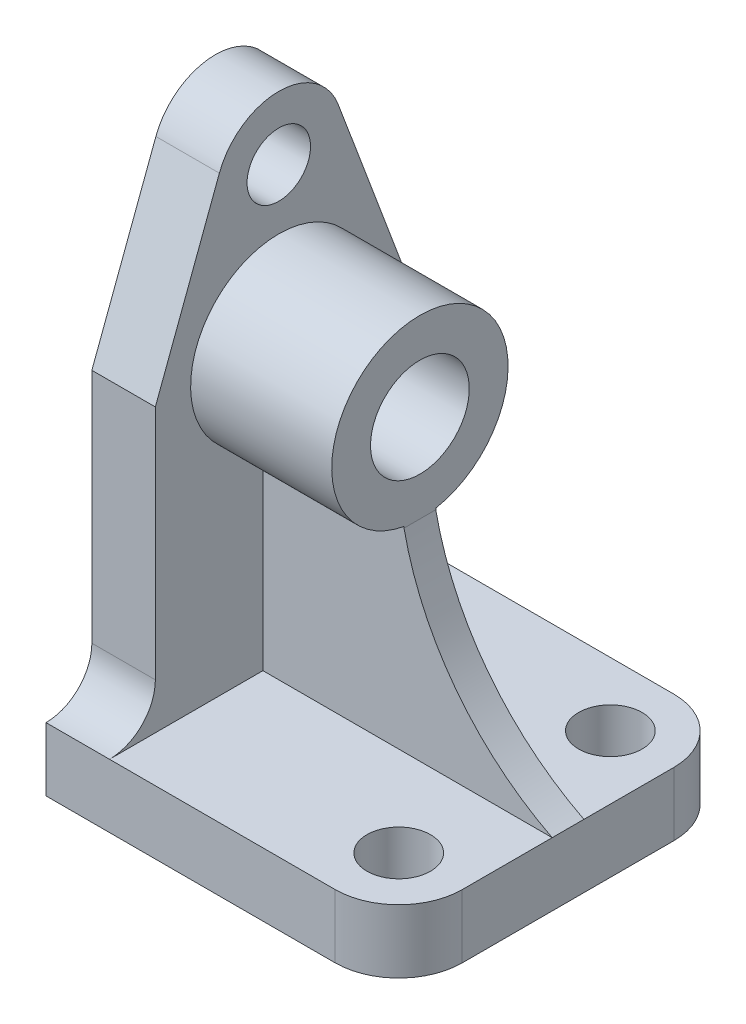
ISO-10303-21;
HEADER;
FILE_DESCRIPTION(('STEP AP214'),'2;1');
FILE_NAME('part.step','',(''),(''),'','','');
FILE_SCHEMA(('AUTOMOTIVE_DESIGN { 1 0 10303 214 1 1 1 1 }'));
ENDSEC;
DATA;
#1=APPLICATION_CONTEXT('core data for automotive mechanical design processes');
#2=APPLICATION_PROTOCOL_DEFINITION('international standard','automotive_design',2000,#1);
#3=PRODUCT_CONTEXT('',#1,'mechanical');
#4=PRODUCT('Part','Part','',(#3));
#5=PRODUCT_RELATED_PRODUCT_CATEGORY('part','',(#4));
#6=PRODUCT_DEFINITION_FORMATION('','',#4);
#7=PRODUCT_DEFINITION_CONTEXT('part definition',#1,'design');
#8=PRODUCT_DEFINITION('design','',#6,#7);
#9=PRODUCT_DEFINITION_SHAPE('','',#8);
#10=(LENGTH_UNIT() NAMED_UNIT(*) SI_UNIT(.MILLI.,.METRE.));
#11=(NAMED_UNIT(*) PLANE_ANGLE_UNIT() SI_UNIT($,.RADIAN.));
#12=(NAMED_UNIT(*) SI_UNIT($,.STERADIAN.) SOLID_ANGLE_UNIT());
#13=UNCERTAINTY_MEASURE_WITH_UNIT(LENGTH_MEASURE(1.E-05),#10,'distance_accuracy_value','');
#14=(GEOMETRIC_REPRESENTATION_CONTEXT(3) GLOBAL_UNCERTAINTY_ASSIGNED_CONTEXT((#13)) GLOBAL_UNIT_ASSIGNED_CONTEXT((#10,
#11,#12)) REPRESENTATION_CONTEXT('',''));
#15=CARTESIAN_POINT('',(0.,0.,0.));
#16=DIRECTION('',(0.,0.,1.));
#17=DIRECTION('',(1.,0.,0.));
#18=AXIS2_PLACEMENT_3D('',#15,#16,#17);
#19=CARTESIAN_POINT('',(0.,18.,48.));
#20=DIRECTION('',(0.,-1.,0.));
#21=DIRECTION('',(0.,0.,-1.));
#22=AXIS2_PLACEMENT_3D('',#19,#20,#21);
#23=PLANE('',#22);
#24=CARTESIAN_POINT('',(82.,18.,-30.));
#25=DIRECTION('',(0.,1.,0.));
#26=DIRECTION('',(0.,0.,1.));
#27=AXIS2_PLACEMENT_3D('',#24,#25,#26);
#28=CIRCLE('',#27,9.);
#29=CARTESIAN_POINT('',(82.,18.,-21.));
#30=VERTEX_POINT('',#29);
#31=EDGE_CURVE('E257',#30,#30,#28,.T.);
#32=ORIENTED_EDGE('',*,*,#31,.F.);
#33=EDGE_LOOP('',(#32));
#34=FACE_BOUND('',#33,.T.);
#35=DIRECTION('',(-1.,0.,0.));
#36=VECTOR('',#35,1.);
#37=CARTESIAN_POINT('',(82.,18.,-4.5));
#38=LINE('',#37,#36);
#39=CARTESIAN_POINT('',(99.9999999999999,18.,-4.5));
#40=VERTEX_POINT('',#39);
#41=CARTESIAN_POINT('',(18.,18.,-4.5));
#42=VERTEX_POINT('',#41);
#43=EDGE_CURVE('E192',#40,#42,#38,.T.);
#44=ORIENTED_EDGE('',*,*,#43,.F.);
#45=DIRECTION('',(0.,0.,-1.));
#46=VECTOR('',#45,1.);
#47=CARTESIAN_POINT('',(100.,18.,48.));
#48=LINE('',#47,#46);
#49=CARTESIAN_POINT('',(100.,18.,-30.));
#50=VERTEX_POINT('',#49);
#51=EDGE_CURVE('E276',#40,#50,#48,.T.);
#52=ORIENTED_EDGE('',*,*,#51,.T.);
#53=CARTESIAN_POINT('',(82.,18.,-30.));
#54=DIRECTION('',(0.,-1.,0.));
#55=DIRECTION('',(0.,0.,-1.));
#56=AXIS2_PLACEMENT_3D('',#53,#54,#55);
#57=CIRCLE('',#56,18.);
#58=CARTESIAN_POINT('',(82.,18.,-48.));
#59=VERTEX_POINT('',#58);
#60=EDGE_CURVE('E300',#50,#59,#57,.F.);
#61=ORIENTED_EDGE('',*,*,#60,.T.);
#62=DIRECTION('',(-1.,0.,0.));
#63=VECTOR('',#62,1.);
#64=CARTESIAN_POINT('',(0.,18.,-48.));
#65=LINE('',#64,#63);
#66=CARTESIAN_POINT('',(18.,18.,-48.));
#67=VERTEX_POINT('',#66);
#68=EDGE_CURVE('E270',#59,#67,#65,.T.);
#69=ORIENTED_EDGE('',*,*,#68,.T.);
#70=DIRECTION('',(0.,0.,1.));
#71=VECTOR('',#70,1.);
#72=CARTESIAN_POINT('',(18.,18.,48.));
#73=LINE('',#72,#71);
#74=EDGE_CURVE('E250',#67,#42,#73,.T.);
#75=ORIENTED_EDGE('',*,*,#74,.T.);
#76=EDGE_LOOP('',(#44,#52,#61,#69,#75));
#77=FACE_BOUND('',#76,.T.);
#78=ADVANCED_FACE('F33',(#34,#77),#23,.F.);
#79=CARTESIAN_POINT('',(0.,0.,48.));
#80=DIRECTION('',(1.,0.,0.));
#81=DIRECTION('',(0.,0.,-1.));
#82=AXIS2_PLACEMENT_3D('',#79,#80,#81);
#83=PLANE('',#82);
#84=CARTESIAN_POINT('',(0.,98.,0.));
#85=DIRECTION('',(1.,0.,0.));
#86=DIRECTION('',(0.,0.,-1.));
#87=AXIS2_PLACEMENT_3D('',#84,#85,#86);
#88=CIRCLE('',#87,14.);
#89=CARTESIAN_POINT('',(0.,98.,14.));
#90=VERTEX_POINT('',#89);
#91=EDGE_CURVE('E199',#90,#90,#88,.T.);
#92=ORIENTED_EDGE('',*,*,#91,.T.);
#93=EDGE_LOOP('',(#92));
#94=FACE_BOUND('',#93,.T.);
#95=DIRECTION('',(0.,-1.,0.));
#96=VECTOR('',#95,1.);
#97=CARTESIAN_POINT('',(0.,0.,-48.));
#98=LINE('',#97,#96);
#99=CARTESIAN_POINT('',(0.,18.,-48.));
#100=VERTEX_POINT('',#99);
#101=CARTESIAN_POINT('',(0.,0.,-48.));
#102=VERTEX_POINT('',#101);
#103=EDGE_CURVE('E263',#100,#102,#98,.T.);
#104=ORIENTED_EDGE('',*,*,#103,.T.);
#105=DIRECTION('',(0.,0.,-1.));
#106=VECTOR('',#105,1.);
#107=CARTESIAN_POINT('',(0.,0.,48.));
#108=LINE('',#107,#106);
#109=CARTESIAN_POINT('',(0.,0.,48.));
#110=VERTEX_POINT('',#109);
#111=EDGE_CURVE('E290',#110,#102,#108,.T.);
#112=ORIENTED_EDGE('',*,*,#111,.F.);
#113=DIRECTION('',(0.,-1.,0.));
#114=VECTOR('',#113,1.);
#115=CARTESIAN_POINT('',(0.,0.,48.));
#116=LINE('',#115,#114);
#117=CARTESIAN_POINT('',(0.,18.,48.));
#118=VERTEX_POINT('',#117);
#119=EDGE_CURVE('E266',#118,#110,#116,.T.);
#120=ORIENTED_EDGE('',*,*,#119,.F.);
#121=CARTESIAN_POINT('',(0.,31.,48.));
#122=DIRECTION('',(1.,0.,0.));
#123=DIRECTION('',(0.,0.,-1.));
#124=AXIS2_PLACEMENT_3D('',#121,#122,#123);
#125=CIRCLE('',#124,13.);
#126=CARTESIAN_POINT('',(0.,31.,35.));
#127=VERTEX_POINT('',#126);
#128=EDGE_CURVE('E321',#118,#127,#125,.T.);
#129=ORIENTED_EDGE('',*,*,#128,.T.);
#130=DIRECTION('',(0.,1.,0.));
#131=VECTOR('',#130,1.);
#132=CARTESIAN_POINT('',(0.,18.,35.));
#133=LINE('',#132,#131);
#134=CARTESIAN_POINT('',(0.,98.,35.));
#135=VERTEX_POINT('',#134);
#136=EDGE_CURVE('E210',#127,#135,#133,.T.);
#137=ORIENTED_EDGE('',*,*,#136,.T.);
#138=DIRECTION('',(0.,0.936163531567605,-0.351564847734909));
#139=VECTOR('',#138,1.);
#140=CARTESIAN_POINT('',(0.,98.,35.));
#141=LINE('',#140,#139);
#142=CARTESIAN_POINT('',(0.,146.328167259228,16.8509435682169));
#143=VERTEX_POINT('',#142);
#144=EDGE_CURVE('E230',#135,#143,#141,.T.);
#145=ORIENTED_EDGE('',*,*,#144,.T.);
#146=CARTESIAN_POINT('',(0.,140.,0.));
#147=DIRECTION('',(-1.,0.,0.));
#148=DIRECTION('',(0.,0.,-1.));
#149=AXIS2_PLACEMENT_3D('',#146,#147,#148);
#150=CIRCLE('',#149,18.);
#151=CARTESIAN_POINT('',(0.,146.328167259228,-16.8509435682169));
#152=VERTEX_POINT('',#151);
#153=EDGE_CURVE('E233',#143,#152,#150,.T.);
#154=ORIENTED_EDGE('',*,*,#153,.T.);
#155=DIRECTION('',(0.,-0.936163531567605,-0.351564847734909));
#156=VECTOR('',#155,1.);
#157=CARTESIAN_POINT('',(0.,98.,-35.));
#158=LINE('',#157,#156);
#159=CARTESIAN_POINT('',(0.,98.,-35.));
#160=VERTEX_POINT('',#159);
#161=EDGE_CURVE('E236',#152,#160,#158,.T.);
#162=ORIENTED_EDGE('',*,*,#161,.T.);
#163=DIRECTION('',(0.,-1.,0.));
#164=VECTOR('',#163,1.);
#165=CARTESIAN_POINT('',(0.,18.,-35.));
#166=LINE('',#165,#164);
#167=CARTESIAN_POINT('',(0.,31.,-35.));
#168=VERTEX_POINT('',#167);
#169=EDGE_CURVE('E216',#160,#168,#166,.T.);
#170=ORIENTED_EDGE('',*,*,#169,.T.);
#171=CARTESIAN_POINT('',(0.,31.,-48.));
#172=DIRECTION('',(1.,0.,0.));
#173=DIRECTION('',(0.,0.,-1.));
#174=AXIS2_PLACEMENT_3D('',#171,#172,#173);
#175=CIRCLE('',#174,13.);
#176=EDGE_CURVE('E317',#168,#100,#175,.T.);
#177=ORIENTED_EDGE('',*,*,#176,.T.);
#178=EDGE_LOOP('',(#104,#112,#120,#129,#137,#145,#154,#162,#170,#177));
#179=FACE_BOUND('',#178,.T.);
#180=CARTESIAN_POINT('',(0.,140.,0.));
#181=DIRECTION('',(-1.,0.,0.));
#182=DIRECTION('',(0.,0.,1.));
#183=AXIS2_PLACEMENT_3D('',#180,#181,#182);
#184=CIRCLE('',#183,9.00000000000001);
#185=CARTESIAN_POINT('',(0.,140.,9.00000000000001));
#186=VERTEX_POINT('',#185);
#187=EDGE_CURVE('E206',#186,#186,#184,.T.);
#188=ORIENTED_EDGE('',*,*,#187,.F.);
#189=EDGE_LOOP('',(#188));
#190=FACE_BOUND('',#189,.T.);
#191=ADVANCED_FACE('F340',(#94,#179,#190),#83,.F.);
#192=CARTESIAN_POINT('',(0.,0.,48.));
#193=DIRECTION('',(0.,1.,0.));
#194=DIRECTION('',(0.,0.,1.));
#195=AXIS2_PLACEMENT_3D('',#192,#193,#194);
#196=PLANE('',#195);
#197=CARTESIAN_POINT('',(82.,0.,30.));
#198=DIRECTION('',(0.,1.,0.));
#199=DIRECTION('',(0.,0.,1.));
#200=AXIS2_PLACEMENT_3D('',#197,#198,#199);
#201=CIRCLE('',#200,9.);
#202=CARTESIAN_POINT('',(82.,0.,39.));
#203=VERTEX_POINT('',#202);
#204=EDGE_CURVE('E254',#203,#203,#201,.T.);
#205=ORIENTED_EDGE('',*,*,#204,.T.);
#206=EDGE_LOOP('',(#205));
#207=FACE_BOUND('',#206,.T.);
#208=CARTESIAN_POINT('',(82.,0.,-30.));
#209=DIRECTION('',(0.,1.,0.));
#210=DIRECTION('',(0.,0.,1.));
#211=AXIS2_PLACEMENT_3D('',#208,#209,#210);
#212=CIRCLE('',#211,9.);
#213=CARTESIAN_POINT('',(82.,0.,-21.));
#214=VERTEX_POINT('',#213);
#215=EDGE_CURVE('E260',#214,#214,#212,.T.);
#216=ORIENTED_EDGE('',*,*,#215,.T.);
#217=EDGE_LOOP('',(#216));
#218=FACE_BOUND('',#217,.T.);
#219=CARTESIAN_POINT('',(82.,0.,30.));
#220=DIRECTION('',(0.,1.,0.));
#221=DIRECTION('',(0.,0.,1.));
#222=AXIS2_PLACEMENT_3D('',#219,#220,#221);
#223=CIRCLE('',#222,18.);
#224=CARTESIAN_POINT('',(100.,0.,30.));
#225=VERTEX_POINT('',#224);
#226=CARTESIAN_POINT('',(82.,0.,48.));
#227=VERTEX_POINT('',#226);
#228=EDGE_CURVE('E305',#225,#227,#223,.F.);
#229=ORIENTED_EDGE('',*,*,#228,.T.);
#230=DIRECTION('',(1.,0.,0.));
#231=VECTOR('',#230,1.);
#232=CARTESIAN_POINT('',(0.,0.,48.));
#233=LINE('',#232,#231);
#234=EDGE_CURVE('E269',#110,#227,#233,.T.);
#235=ORIENTED_EDGE('',*,*,#234,.F.);
#236=ORIENTED_EDGE('',*,*,#111,.T.);
#237=DIRECTION('',(1.,0.,0.));
#238=VECTOR('',#237,1.);
#239=CARTESIAN_POINT('',(0.,0.,-48.));
#240=LINE('',#239,#238);
#241=CARTESIAN_POINT('',(82.,0.,-48.));
#242=VERTEX_POINT('',#241);
#243=EDGE_CURVE('E279',#102,#242,#240,.T.);
#244=ORIENTED_EDGE('',*,*,#243,.T.);
#245=CARTESIAN_POINT('',(82.,0.,-30.));
#246=DIRECTION('',(0.,1.,0.));
#247=DIRECTION('',(0.,0.,1.));
#248=AXIS2_PLACEMENT_3D('',#245,#246,#247);
#249=CIRCLE('',#248,18.);
#250=CARTESIAN_POINT('',(100.,0.,-30.));
#251=VERTEX_POINT('',#250);
#252=EDGE_CURVE('E308',#242,#251,#249,.F.);
#253=ORIENTED_EDGE('',*,*,#252,.T.);
#254=DIRECTION('',(0.,0.,-1.));
#255=VECTOR('',#254,1.);
#256=CARTESIAN_POINT('',(100.,0.,48.));
#257=LINE('',#256,#255);
#258=EDGE_CURVE('E287',#225,#251,#257,.T.);
#259=ORIENTED_EDGE('',*,*,#258,.F.);
#260=EDGE_LOOP('',(#229,#235,#236,#244,#253,#259));
#261=FACE_BOUND('',#260,.T.);
#262=ADVANCED_FACE('F382',(#207,#218,#261),#196,.F.);
#263=CARTESIAN_POINT('',(100.,0.,48.));
#264=DIRECTION('',(-1.,0.,0.));
#265=DIRECTION('',(0.,0.,1.));
#266=AXIS2_PLACEMENT_3D('',#263,#264,#265);
#267=PLANE('',#266);
#268=ORIENTED_EDGE('',*,*,#258,.T.);
#269=DIRECTION('',(0.,1.,0.));
#270=VECTOR('',#269,1.);
#271=CARTESIAN_POINT('',(100.,18.,-30.));
#272=LINE('',#271,#270);
#273=EDGE_CURVE('E295',#251,#50,#272,.T.);
#274=ORIENTED_EDGE('',*,*,#273,.T.);
#275=ORIENTED_EDGE('',*,*,#51,.F.);
#276=DIRECTION('',(0.,0.,-1.));
#277=VECTOR('',#276,1.);
#278=CARTESIAN_POINT('',(99.9999999999999,18.,4.5));
#279=LINE('',#278,#277);
#280=CARTESIAN_POINT('',(99.9999999999999,18.,4.5));
#281=VERTEX_POINT('',#280);
#282=EDGE_CURVE('E170',#281,#40,#279,.T.);
#283=ORIENTED_EDGE('',*,*,#282,.F.);
#284=CARTESIAN_POINT('',(100.,18.,30.));
#285=VERTEX_POINT('',#284);
#286=EDGE_CURVE('E284',#285,#281,#48,.T.);
#287=ORIENTED_EDGE('',*,*,#286,.F.);
#288=DIRECTION('',(0.,1.,0.));
#289=VECTOR('',#288,1.);
#290=CARTESIAN_POINT('',(100.,0.,30.));
#291=LINE('',#290,#289);
#292=EDGE_CURVE('E293',#285,#225,#291,.F.);
#293=ORIENTED_EDGE('',*,*,#292,.T.);
#294=EDGE_LOOP('',(#268,#274,#275,#283,#287,#293));
#295=FACE_BOUND('',#294,.T.);
#296=ADVANCED_FACE('F385',(#295),#267,.F.);
#297=CARTESIAN_POINT('',(82.,18.,30.));
#298=DIRECTION('',(0.,1.,0.));
#299=DIRECTION('',(0.,0.,1.));
#300=AXIS2_PLACEMENT_3D('',#297,#298,#299);
#301=CIRCLE('',#300,9.);
#302=CARTESIAN_POINT('',(82.,18.,39.));
#303=VERTEX_POINT('',#302);
#304=EDGE_CURVE('E253',#303,#303,#301,.T.);
#305=ORIENTED_EDGE('',*,*,#304,.F.);
#306=EDGE_LOOP('',(#305));
#307=FACE_BOUND('',#306,.T.);
#308=ORIENTED_EDGE('',*,*,#286,.T.);
#309=DIRECTION('',(-1.,0.,0.));
#310=VECTOR('',#309,1.);
#311=CARTESIAN_POINT('',(100.,18.,4.5));
#312=LINE('',#311,#310);
#313=CARTESIAN_POINT('',(18.,18.,4.5));
#314=VERTEX_POINT('',#313);
#315=EDGE_CURVE('E171',#281,#314,#312,.T.);
#316=ORIENTED_EDGE('',*,*,#315,.T.);
#317=CARTESIAN_POINT('',(18.,18.,48.));
#318=VERTEX_POINT('',#317);
#319=EDGE_CURVE('E243',#314,#318,#73,.T.);
#320=ORIENTED_EDGE('',*,*,#319,.T.);
#321=DIRECTION('',(-1.,0.,0.));
#322=VECTOR('',#321,1.);
#323=CARTESIAN_POINT('',(0.,18.,48.));
#324=LINE('',#323,#322);
#325=CARTESIAN_POINT('',(82.,18.,48.));
#326=VERTEX_POINT('',#325);
#327=EDGE_CURVE('E273',#326,#318,#324,.T.);
#328=ORIENTED_EDGE('',*,*,#327,.F.);
#329=CARTESIAN_POINT('',(82.,18.,30.));
#330=DIRECTION('',(0.,-1.,0.));
#331=DIRECTION('',(0.,0.,-1.));
#332=AXIS2_PLACEMENT_3D('',#329,#330,#331);
#333=CIRCLE('',#332,18.);
#334=EDGE_CURVE('E298',#326,#285,#333,.F.);
#335=ORIENTED_EDGE('',*,*,#334,.T.);
#336=EDGE_LOOP('',(#308,#316,#320,#328,#335));
#337=FACE_BOUND('',#336,.T.);
#338=ADVANCED_FACE('F390',(#307,#337),#23,.F.);
#339=CARTESIAN_POINT('',(0.,0.,48.));
#340=DIRECTION('',(0.,0.,-1.));
#341=DIRECTION('',(-1.,0.,0.));
#342=AXIS2_PLACEMENT_3D('',#339,#340,#341);
#343=PLANE('',#342);
#344=ORIENTED_EDGE('',*,*,#327,.T.);
#345=EDGE_CURVE('E272',#318,#118,#324,.T.);
#346=ORIENTED_EDGE('',*,*,#345,.T.);
#347=ORIENTED_EDGE('',*,*,#119,.T.);
#348=ORIENTED_EDGE('',*,*,#234,.T.);
#349=DIRECTION('',(0.,1.,0.));
#350=VECTOR('',#349,1.);
#351=CARTESIAN_POINT('',(82.,0.,48.));
#352=LINE('',#351,#350);
#353=EDGE_CURVE('E310',#227,#326,#352,.T.);
#354=ORIENTED_EDGE('',*,*,#353,.T.);
#355=EDGE_LOOP('',(#344,#346,#347,#348,#354));
#356=FACE_BOUND('',#355,.T.);
#357=ADVANCED_FACE('F335',(#356),#343,.F.);
#358=CARTESIAN_POINT('',(0.,0.,-48.));
#359=DIRECTION('',(0.,0.,-1.));
#360=DIRECTION('',(-1.,0.,0.));
#361=AXIS2_PLACEMENT_3D('',#358,#359,#360);
#362=PLANE('',#361);
#363=DIRECTION('',(0.,1.,0.));
#364=VECTOR('',#363,1.);
#365=CARTESIAN_POINT('',(82.,0.,-48.));
#366=LINE('',#365,#364);
#367=EDGE_CURVE('E302',#59,#242,#366,.F.);
#368=ORIENTED_EDGE('',*,*,#367,.T.);
#369=ORIENTED_EDGE('',*,*,#243,.F.);
#370=ORIENTED_EDGE('',*,*,#103,.F.);
#371=EDGE_CURVE('E281',#67,#100,#65,.T.);
#372=ORIENTED_EDGE('',*,*,#371,.F.);
#373=ORIENTED_EDGE('',*,*,#68,.F.);
#374=EDGE_LOOP('',(#368,#369,#370,#372,#373));
#375=FACE_BOUND('',#374,.T.);
#376=ADVANCED_FACE('F366',(#375),#362,.T.);
#377=CARTESIAN_POINT('',(82.,0.,-30.));
#378=DIRECTION('',(0.,-1.,0.));
#379=DIRECTION('',(0.,0.,-1.));
#380=AXIS2_PLACEMENT_3D('',#377,#378,#379);
#381=CYLINDRICAL_SURFACE('',#380,18.);
#382=ORIENTED_EDGE('',*,*,#252,.F.);
#383=ORIENTED_EDGE('',*,*,#367,.F.);
#384=ORIENTED_EDGE('',*,*,#60,.F.);
#385=ORIENTED_EDGE('',*,*,#273,.F.);
#386=EDGE_LOOP('',(#382,#383,#384,#385));
#387=FACE_BOUND('',#386,.T.);
#388=ADVANCED_FACE('F378',(#387),#381,.T.);
#389=CARTESIAN_POINT('',(82.,0.,30.));
#390=DIRECTION('',(0.,1.,0.));
#391=DIRECTION('',(0.,0.,1.));
#392=AXIS2_PLACEMENT_3D('',#389,#390,#391);
#393=CYLINDRICAL_SURFACE('',#392,18.);
#394=ORIENTED_EDGE('',*,*,#228,.F.);
#395=ORIENTED_EDGE('',*,*,#292,.F.);
#396=ORIENTED_EDGE('',*,*,#334,.F.);
#397=ORIENTED_EDGE('',*,*,#353,.F.);
#398=EDGE_LOOP('',(#394,#395,#396,#397));
#399=FACE_BOUND('',#398,.T.);
#400=ADVANCED_FACE('F389',(#399),#393,.T.);
#401=CARTESIAN_POINT('',(82.,0.,-30.));
#402=DIRECTION('',(0.,1.,0.));
#403=DIRECTION('',(0.,0.,1.));
#404=AXIS2_PLACEMENT_3D('',#401,#402,#403);
#405=CYLINDRICAL_SURFACE('',#404,9.);
#406=ORIENTED_EDGE('',*,*,#215,.F.);
#407=EDGE_LOOP('',(#406));
#408=FACE_BOUND('',#407,.T.);
#409=ORIENTED_EDGE('',*,*,#31,.T.);
#410=EDGE_LOOP('',(#409));
#411=FACE_BOUND('',#410,.T.);
#412=ADVANCED_FACE('F411',(#408,#411),#405,.F.);
#413=CARTESIAN_POINT('',(82.,0.,30.));
#414=DIRECTION('',(0.,1.,0.));
#415=DIRECTION('',(0.,0.,1.));
#416=AXIS2_PLACEMENT_3D('',#413,#414,#415);
#417=CYLINDRICAL_SURFACE('',#416,9.);
#418=ORIENTED_EDGE('',*,*,#204,.F.);
#419=EDGE_LOOP('',(#418));
#420=FACE_BOUND('',#419,.T.);
#421=ORIENTED_EDGE('',*,*,#304,.T.);
#422=EDGE_LOOP('',(#421));
#423=FACE_BOUND('',#422,.T.);
#424=ADVANCED_FACE('F413',(#420,#423),#417,.F.);
#425=CARTESIAN_POINT('',(18.,140.,0.));
#426=DIRECTION('',(1.,0.,0.));
#427=DIRECTION('',(0.,0.,-1.));
#428=AXIS2_PLACEMENT_3D('',#425,#426,#427);
#429=PLANE('',#428);
#430=DIRECTION('',(0.,1.,0.));
#431=VECTOR('',#430,1.);
#432=CARTESIAN_POINT('',(18.,18.,4.5));
#433=LINE('',#432,#431);
#434=CARTESIAN_POINT('',(18.,73.4083347452841,4.5));
#435=VERTEX_POINT('',#434);
#436=EDGE_CURVE('E180',#314,#435,#433,.T.);
#437=ORIENTED_EDGE('',*,*,#436,.T.);
#438=CARTESIAN_POINT('',(18.,98.,0.));
#439=DIRECTION('',(1.,0.,0.));
#440=DIRECTION('',(0.,0.,-1.));
#441=AXIS2_PLACEMENT_3D('',#438,#439,#440);
#442=CIRCLE('',#441,25.);
#443=CARTESIAN_POINT('',(18.,73.4083347452841,-4.5));
#444=VERTEX_POINT('',#443);
#445=EDGE_CURVE('E11',#444,#435,#442,.T.);
#446=ORIENTED_EDGE('',*,*,#445,.F.);
#447=DIRECTION('',(0.,1.,0.));
#448=VECTOR('',#447,1.);
#449=CARTESIAN_POINT('',(18.,31.,-4.5));
#450=LINE('',#449,#448);
#451=EDGE_CURVE('E48',#42,#444,#450,.T.);
#452=ORIENTED_EDGE('',*,*,#451,.F.);
#453=ORIENTED_EDGE('',*,*,#74,.F.);
#454=CARTESIAN_POINT('',(18.,31.,-48.));
#455=DIRECTION('',(1.,0.,0.));
#456=DIRECTION('',(0.,0.,-1.));
#457=AXIS2_PLACEMENT_3D('',#454,#455,#456);
#458=CIRCLE('',#457,13.);
#459=CARTESIAN_POINT('',(18.,31.,-35.));
#460=VERTEX_POINT('',#459);
#461=EDGE_CURVE('E319',#67,#460,#458,.F.);
#462=ORIENTED_EDGE('',*,*,#461,.T.);
#463=DIRECTION('',(0.,-1.,0.));
#464=VECTOR('',#463,1.);
#465=CARTESIAN_POINT('',(18.,18.,-35.));
#466=LINE('',#465,#464);
#467=CARTESIAN_POINT('',(18.,98.,-35.));
#468=VERTEX_POINT('',#467);
#469=EDGE_CURVE('E225',#468,#460,#466,.T.);
#470=ORIENTED_EDGE('',*,*,#469,.F.);
#471=DIRECTION('',(0.,-0.936163531567605,-0.351564847734909));
#472=VECTOR('',#471,1.);
#473=CARTESIAN_POINT('',(18.,98.,-35.));
#474=LINE('',#473,#472);
#475=CARTESIAN_POINT('',(18.,146.328167259228,-16.8509435682169));
#476=VERTEX_POINT('',#475);
#477=EDGE_CURVE('E222',#476,#468,#474,.T.);
#478=ORIENTED_EDGE('',*,*,#477,.F.);
#479=CARTESIAN_POINT('',(18.,140.,0.));
#480=DIRECTION('',(-1.,0.,0.));
#481=DIRECTION('',(0.,0.,-1.));
#482=AXIS2_PLACEMENT_3D('',#479,#480,#481);
#483=CIRCLE('',#482,18.);
#484=CARTESIAN_POINT('',(18.,146.328167259228,16.8509435682169));
#485=VERTEX_POINT('',#484);
#486=EDGE_CURVE('E219',#485,#476,#483,.T.);
#487=ORIENTED_EDGE('',*,*,#486,.F.);
#488=DIRECTION('',(0.,0.936163531567605,-0.351564847734909));
#489=VECTOR('',#488,1.);
#490=CARTESIAN_POINT('',(18.,98.,35.));
#491=LINE('',#490,#489);
#492=CARTESIAN_POINT('',(18.,98.,35.));
#493=VERTEX_POINT('',#492);
#494=EDGE_CURVE('E215',#493,#485,#491,.T.);
#495=ORIENTED_EDGE('',*,*,#494,.F.);
#496=DIRECTION('',(0.,1.,0.));
#497=VECTOR('',#496,1.);
#498=CARTESIAN_POINT('',(18.,18.,35.));
#499=LINE('',#498,#497);
#500=CARTESIAN_POINT('',(18.,31.,35.));
#501=VERTEX_POINT('',#500);
#502=EDGE_CURVE('E213',#501,#493,#499,.T.);
#503=ORIENTED_EDGE('',*,*,#502,.F.);
#504=CARTESIAN_POINT('',(18.,31.,48.));
#505=DIRECTION('',(1.,0.,0.));
#506=DIRECTION('',(0.,0.,-1.));
#507=AXIS2_PLACEMENT_3D('',#504,#505,#506);
#508=CIRCLE('',#507,13.);
#509=EDGE_CURVE('E41',#501,#318,#508,.F.);
#510=ORIENTED_EDGE('',*,*,#509,.T.);
#511=ORIENTED_EDGE('',*,*,#319,.F.);
#512=EDGE_LOOP('',(#437,#446,#452,#453,#462,#470,#478,#487,#495,#503,#510,#511));
#513=FACE_BOUND('',#512,.T.);
#514=CARTESIAN_POINT('',(18.,140.,0.));
#515=DIRECTION('',(-1.,0.,0.));
#516=DIRECTION('',(0.,0.,1.));
#517=AXIS2_PLACEMENT_3D('',#514,#515,#516);
#518=CIRCLE('',#517,9.00000000000001);
#519=CARTESIAN_POINT('',(18.,140.,9.00000000000001));
#520=VERTEX_POINT('',#519);
#521=EDGE_CURVE('E207',#520,#520,#518,.T.);
#522=ORIENTED_EDGE('',*,*,#521,.T.);
#523=EDGE_LOOP('',(#522));
#524=FACE_BOUND('',#523,.T.);
#525=ADVANCED_FACE('F327',(#513,#524),#429,.T.);
#526=CARTESIAN_POINT('',(18.,18.,-35.));
#527=DIRECTION('',(0.,0.,-1.));
#528=DIRECTION('',(0.,1.,0.));
#529=AXIS2_PLACEMENT_3D('',#526,#527,#528);
#530=PLANE('',#529);
#531=ORIENTED_EDGE('',*,*,#469,.T.);
#532=DIRECTION('',(-1.,0.,0.));
#533=VECTOR('',#532,1.);
#534=CARTESIAN_POINT('',(18.,31.,-35.));
#535=LINE('',#534,#533);
#536=EDGE_CURVE('E313',#460,#168,#535,.T.);
#537=ORIENTED_EDGE('',*,*,#536,.T.);
#538=ORIENTED_EDGE('',*,*,#169,.F.);
#539=DIRECTION('',(-1.,0.,0.));
#540=VECTOR('',#539,1.);
#541=CARTESIAN_POINT('',(18.,98.,-35.));
#542=LINE('',#541,#540);
#543=EDGE_CURVE('E241',#468,#160,#542,.T.);
#544=ORIENTED_EDGE('',*,*,#543,.F.);
#545=EDGE_LOOP('',(#531,#537,#538,#544));
#546=FACE_BOUND('',#545,.T.);
#547=ADVANCED_FACE('F359',(#546),#530,.T.);
#548=CARTESIAN_POINT('',(18.,98.,-35.));
#549=DIRECTION('',(0.,0.351564847734909,-0.936163531567605));
#550=DIRECTION('',(0.,0.936163531567605,0.351564847734909));
#551=AXIS2_PLACEMENT_3D('',#548,#549,#550);
#552=PLANE('',#551);
#553=ORIENTED_EDGE('',*,*,#161,.F.);
#554=DIRECTION('',(-1.,0.,0.));
#555=VECTOR('',#554,1.);
#556=CARTESIAN_POINT('',(18.,146.328167259228,-16.8509435682169));
#557=LINE('',#556,#555);
#558=EDGE_CURVE('E244',#476,#152,#557,.T.);
#559=ORIENTED_EDGE('',*,*,#558,.F.);
#560=ORIENTED_EDGE('',*,*,#477,.T.);
#561=ORIENTED_EDGE('',*,*,#543,.T.);
#562=EDGE_LOOP('',(#553,#559,#560,#561));
#563=FACE_BOUND('',#562,.T.);
#564=ADVANCED_FACE('F356',(#563),#552,.T.);
#565=CARTESIAN_POINT('',(18.,140.,0.));
#566=DIRECTION('',(-1.,0.,0.));
#567=DIRECTION('',(0.,0.,1.));
#568=AXIS2_PLACEMENT_3D('',#565,#566,#567);
#569=CYLINDRICAL_SURFACE('',#568,18.);
#570=ORIENTED_EDGE('',*,*,#153,.F.);
#571=DIRECTION('',(-1.,0.,0.));
#572=VECTOR('',#571,1.);
#573=CARTESIAN_POINT('',(18.,146.328167259228,16.8509435682169));
#574=LINE('',#573,#572);
#575=EDGE_CURVE('E246',#485,#143,#574,.T.);
#576=ORIENTED_EDGE('',*,*,#575,.F.);
#577=ORIENTED_EDGE('',*,*,#486,.T.);
#578=ORIENTED_EDGE('',*,*,#558,.T.);
#579=EDGE_LOOP('',(#570,#576,#577,#578));
#580=FACE_BOUND('',#579,.T.);
#581=ADVANCED_FACE('F352',(#580),#569,.T.);
#582=CARTESIAN_POINT('',(18.,98.,35.));
#583=DIRECTION('',(0.,0.351564847734909,0.936163531567605));
#584=DIRECTION('',(0.,-0.936163531567605,0.351564847734909));
#585=AXIS2_PLACEMENT_3D('',#582,#583,#584);
#586=PLANE('',#585);
#587=ORIENTED_EDGE('',*,*,#144,.F.);
#588=DIRECTION('',(-1.,0.,0.));
#589=VECTOR('',#588,1.);
#590=CARTESIAN_POINT('',(18.,98.,35.));
#591=LINE('',#590,#589);
#592=EDGE_CURVE('E228',#493,#135,#591,.T.);
#593=ORIENTED_EDGE('',*,*,#592,.F.);
#594=ORIENTED_EDGE('',*,*,#494,.T.);
#595=ORIENTED_EDGE('',*,*,#575,.T.);
#596=EDGE_LOOP('',(#587,#593,#594,#595));
#597=FACE_BOUND('',#596,.T.);
#598=ADVANCED_FACE('F347',(#597),#586,.T.);
#599=CARTESIAN_POINT('',(18.,18.,35.));
#600=DIRECTION('',(0.,0.,1.));
#601=DIRECTION('',(0.,-1.,0.));
#602=AXIS2_PLACEMENT_3D('',#599,#600,#601);
#603=PLANE('',#602);
#604=ORIENTED_EDGE('',*,*,#136,.F.);
#605=DIRECTION('',(-1.,0.,0.));
#606=VECTOR('',#605,1.);
#607=CARTESIAN_POINT('',(18.,31.,35.));
#608=LINE('',#607,#606);
#609=EDGE_CURVE('E56',#127,#501,#608,.F.);
#610=ORIENTED_EDGE('',*,*,#609,.T.);
#611=ORIENTED_EDGE('',*,*,#502,.T.);
#612=ORIENTED_EDGE('',*,*,#592,.T.);
#613=EDGE_LOOP('',(#604,#610,#611,#612));
#614=FACE_BOUND('',#613,.T.);
#615=ADVANCED_FACE('F343',(#614),#603,.T.);
#616=CARTESIAN_POINT('',(18.,140.,0.));
#617=DIRECTION('',(-1.,0.,0.));
#618=DIRECTION('',(0.,0.,1.));
#619=AXIS2_PLACEMENT_3D('',#616,#617,#618);
#620=CYLINDRICAL_SURFACE('',#619,9.00000000000001);
#621=ORIENTED_EDGE('',*,*,#521,.F.);
#622=EDGE_LOOP('',(#621));
#623=FACE_BOUND('',#622,.T.);
#624=ORIENTED_EDGE('',*,*,#187,.T.);
#625=EDGE_LOOP('',(#624));
#626=FACE_BOUND('',#625,.T.);
#627=ADVANCED_FACE('F434',(#623,#626),#620,.F.);
#628=CARTESIAN_POINT('',(18.,31.,-48.));
#629=DIRECTION('',(-1.,0.,0.));
#630=DIRECTION('',(0.,0.,1.));
#631=AXIS2_PLACEMENT_3D('',#628,#629,#630);
#632=CYLINDRICAL_SURFACE('',#631,13.);
#633=ORIENTED_EDGE('',*,*,#461,.F.);
#634=ORIENTED_EDGE('',*,*,#371,.T.);
#635=ORIENTED_EDGE('',*,*,#176,.F.);
#636=ORIENTED_EDGE('',*,*,#536,.F.);
#637=EDGE_LOOP('',(#633,#634,#635,#636));
#638=FACE_BOUND('',#637,.T.);
#639=ADVANCED_FACE('F369',(#638),#632,.F.);
#640=CARTESIAN_POINT('',(0.,31.,48.));
#641=DIRECTION('',(-1.,0.,0.));
#642=DIRECTION('',(0.,0.,1.));
#643=AXIS2_PLACEMENT_3D('',#640,#641,#642);
#644=CYLINDRICAL_SURFACE('',#643,13.);
#645=ORIENTED_EDGE('',*,*,#509,.F.);
#646=ORIENTED_EDGE('',*,*,#609,.F.);
#647=ORIENTED_EDGE('',*,*,#128,.F.);
#648=ORIENTED_EDGE('',*,*,#345,.F.);
#649=EDGE_LOOP('',(#645,#646,#647,#648));
#650=FACE_BOUND('',#649,.T.);
#651=ADVANCED_FACE('F35',(#650),#644,.F.);
#652=CARTESIAN_POINT('',(58.,98.,0.));
#653=DIRECTION('',(-1.,0.,0.));
#654=DIRECTION('',(0.,0.,1.));
#655=AXIS2_PLACEMENT_3D('',#652,#653,#654);
#656=CYLINDRICAL_SURFACE('',#655,25.);
#657=DIRECTION('',(-1.,0.,0.));
#658=VECTOR('',#657,1.);
#659=CARTESIAN_POINT('',(58.,73.4083347452841,4.5));
#660=LINE('',#659,#658);
#661=CARTESIAN_POINT('',(58.,73.4083347452841,4.5));
#662=VERTEX_POINT('',#661);
#663=EDGE_CURVE('E197',#662,#435,#660,.T.);
#664=ORIENTED_EDGE('',*,*,#663,.F.);
#665=CARTESIAN_POINT('',(58.,98.,0.));
#666=DIRECTION('',(-1.,0.,0.));
#667=DIRECTION('',(0.,0.,1.));
#668=AXIS2_PLACEMENT_3D('',#665,#666,#667);
#669=CIRCLE('',#668,25.);
#670=CARTESIAN_POINT('',(58.,73.4083347452841,-4.5));
#671=VERTEX_POINT('',#670);
#672=EDGE_CURVE('E177',#662,#671,#669,.T.);
#673=ORIENTED_EDGE('',*,*,#672,.T.);
#674=DIRECTION('',(-1.,0.,0.));
#675=VECTOR('',#674,1.);
#676=CARTESIAN_POINT('',(58.,73.4083347452841,-4.5));
#677=LINE('',#676,#675);
#678=EDGE_CURVE('E194',#671,#444,#677,.T.);
#679=ORIENTED_EDGE('',*,*,#678,.T.);
#680=ORIENTED_EDGE('',*,*,#445,.T.);
#681=EDGE_LOOP('',(#664,#673,#679,#680));
#682=FACE_BOUND('',#681,.T.);
#683=ADVANCED_FACE('F439',(#682),#656,.T.);
#684=CARTESIAN_POINT('',(58.,98.,0.));
#685=DIRECTION('',(-1.,0.,0.));
#686=DIRECTION('',(0.,0.,1.));
#687=AXIS2_PLACEMENT_3D('',#684,#685,#686);
#688=PLANE('',#687);
#689=CARTESIAN_POINT('',(58.,98.,0.));
#690=DIRECTION('',(-1.,0.,0.));
#691=DIRECTION('',(0.,0.,1.));
#692=AXIS2_PLACEMENT_3D('',#689,#690,#691);
#693=CIRCLE('',#692,14.);
#694=CARTESIAN_POINT('',(58.,98.,14.));
#695=VERTEX_POINT('',#694);
#696=EDGE_CURVE('E202',#695,#695,#693,.T.);
#697=ORIENTED_EDGE('',*,*,#696,.T.);
#698=EDGE_LOOP('',(#697));
#699=FACE_BOUND('',#698,.T.);
#700=ORIENTED_EDGE('',*,*,#672,.F.);
#701=DIRECTION('',(0.,1.,0.));
#702=VECTOR('',#701,1.);
#703=CARTESIAN_POINT('',(58.,73.,4.5));
#704=LINE('',#703,#702);
#705=CARTESIAN_POINT('',(58.,73.,4.5));
#706=VERTEX_POINT('',#705);
#707=EDGE_CURVE('E174',#706,#662,#704,.T.);
#708=ORIENTED_EDGE('',*,*,#707,.F.);
#709=DIRECTION('',(0.,0.,-1.));
#710=VECTOR('',#709,1.);
#711=CARTESIAN_POINT('',(58.,73.,4.5));
#712=LINE('',#711,#710);
#713=CARTESIAN_POINT('',(58.,73.,-4.5));
#714=VERTEX_POINT('',#713);
#715=EDGE_CURVE('E159',#706,#714,#712,.T.);
#716=ORIENTED_EDGE('',*,*,#715,.T.);
#717=DIRECTION('',(0.,1.,0.));
#718=VECTOR('',#717,1.);
#719=CARTESIAN_POINT('',(58.,73.,-4.5));
#720=LINE('',#719,#718);
#721=EDGE_CURVE('E189',#714,#671,#720,.T.);
#722=ORIENTED_EDGE('',*,*,#721,.T.);
#723=EDGE_LOOP('',(#700,#708,#716,#722));
#724=FACE_BOUND('',#723,.T.);
#725=ADVANCED_FACE('F175',(#699,#724),#688,.F.);
#726=CARTESIAN_POINT('',(58.,98.,0.));
#727=DIRECTION('',(-1.,0.,0.));
#728=DIRECTION('',(0.,0.,1.));
#729=AXIS2_PLACEMENT_3D('',#726,#727,#728);
#730=CYLINDRICAL_SURFACE('',#729,14.);
#731=CARTESIAN_POINT('',(58.,98.,14.));
#732=CARTESIAN_POINT('',(57.3958333333333,98.,14.));
#733=CARTESIAN_POINT('',(56.7916666666667,98.,14.));
#734=CARTESIAN_POINT('',(55.5833333333333,98.,14.));
#735=CARTESIAN_POINT('',(54.9791666666667,98.,14.));
#736=CARTESIAN_POINT('',(53.7708333333333,98.,14.));
#737=CARTESIAN_POINT('',(53.1666666666667,98.,14.));
#738=CARTESIAN_POINT('',(51.9583333333333,98.,14.));
#739=CARTESIAN_POINT('',(51.3541666666667,98.,14.));
#740=CARTESIAN_POINT('',(50.1458333333333,98.,14.));
#741=CARTESIAN_POINT('',(49.5416666666667,98.,14.));
#742=CARTESIAN_POINT('',(48.3333333333333,98.,14.));
#743=CARTESIAN_POINT('',(47.7291666666667,98.,14.));
#744=CARTESIAN_POINT('',(46.5208333333333,98.,14.));
#745=CARTESIAN_POINT('',(45.9166666666667,98.,14.));
#746=CARTESIAN_POINT('',(44.7083333333333,98.,14.));
#747=CARTESIAN_POINT('',(44.1041666666667,98.,14.));
#748=CARTESIAN_POINT('',(42.8958333333333,98.,14.));
#749=CARTESIAN_POINT('',(42.2916666666667,98.,14.));
#750=CARTESIAN_POINT('',(41.0833333333333,98.,14.));
#751=CARTESIAN_POINT('',(40.4791666666667,98.,14.));
#752=CARTESIAN_POINT('',(39.2708333333333,98.,14.));
#753=CARTESIAN_POINT('',(38.6666666666667,98.,14.));
#754=CARTESIAN_POINT('',(37.4583333333333,98.,14.));
#755=CARTESIAN_POINT('',(36.8541666666667,98.,14.));
#756=CARTESIAN_POINT('',(35.6458333333333,98.,14.));
#757=CARTESIAN_POINT('',(35.0416666666667,98.,14.));
#758=CARTESIAN_POINT('',(33.8333333333333,98.,14.));
#759=CARTESIAN_POINT('',(33.2291666666667,98.,14.));
#760=CARTESIAN_POINT('',(32.0208333333333,98.,14.));
#761=CARTESIAN_POINT('',(31.4166666666667,98.,14.));
#762=CARTESIAN_POINT('',(30.2083333333333,98.,14.));
#763=CARTESIAN_POINT('',(29.6041666666667,98.,14.));
#764=CARTESIAN_POINT('',(28.3958333333333,98.,14.));
#765=CARTESIAN_POINT('',(27.7916666666667,98.,14.));
#766=CARTESIAN_POINT('',(26.5833333333333,98.,14.));
#767=CARTESIAN_POINT('',(25.9791666666667,98.,14.));
#768=CARTESIAN_POINT('',(24.7708333333333,98.,14.));
#769=CARTESIAN_POINT('',(24.1666666666667,98.,14.));
#770=CARTESIAN_POINT('',(22.9583333333333,98.,14.));
#771=CARTESIAN_POINT('',(22.3541666666667,98.,14.));
#772=CARTESIAN_POINT('',(21.1458333333333,98.,14.));
#773=CARTESIAN_POINT('',(20.5416666666667,98.,14.));
#774=CARTESIAN_POINT('',(19.3333333333333,98.,14.));
#775=CARTESIAN_POINT('',(18.7291666666667,98.,14.));
#776=CARTESIAN_POINT('',(17.5208333333333,98.,14.));
#777=CARTESIAN_POINT('',(16.9166666666667,98.,14.));
#778=CARTESIAN_POINT('',(15.7083333333333,98.,14.));
#779=CARTESIAN_POINT('',(15.1041666666667,98.,14.));
#780=CARTESIAN_POINT('',(13.8958333333333,98.,14.));
#781=CARTESIAN_POINT('',(13.2916666666667,98.,14.));
#782=CARTESIAN_POINT('',(12.0833333333333,98.,14.));
#783=CARTESIAN_POINT('',(11.4791666666667,98.,14.));
#784=CARTESIAN_POINT('',(10.2708333333333,98.,14.));
#785=CARTESIAN_POINT('',(9.66666666666667,98.,14.));
#786=CARTESIAN_POINT('',(8.45833333333333,98.,14.));
#787=CARTESIAN_POINT('',(7.85416666666667,98.,14.));
#788=CARTESIAN_POINT('',(6.64583333333333,98.,14.));
#789=CARTESIAN_POINT('',(6.04166666666667,98.,14.));
#790=CARTESIAN_POINT('',(4.83333333333334,98.,14.));
#791=CARTESIAN_POINT('',(4.22916666666667,98.,14.));
#792=CARTESIAN_POINT('',(3.02083333333334,98.,14.));
#793=CARTESIAN_POINT('',(2.41666666666667,98.,14.));
#794=CARTESIAN_POINT('',(1.20833333333333,98.,14.));
#795=CARTESIAN_POINT('',(0.604166666666667,98.,14.));
#796=CARTESIAN_POINT('',(0.,98.,14.));
#797=B_SPLINE_CURVE_WITH_KNOTS('',3,(#731,#732,#733,#734,#735,#736,#737,#738,#739,#740,#741,
#742,#743,#744,#745,#746,#747,#748,#749,#750,#751,#752,#753,#754,#755,#756,#757,#758,#759,#760,
#761,#762,#763,#764,#765,#766,#767,#768,#769,#770,#771,#772,#773,#774,#775,#776,#777,#778,#779,
#780,#781,#782,#783,#784,#785,#786,#787,#788,#789,#790,#791,#792,#793,#794,#795,#796),
.UNSPECIFIED.,.F.,.F.,(4,2,2,2,2,2,2,2,2,2,2,2,2,2,2,2,2,2,2,2,2,2,2,2,2,2,2,2,2,2,2,2,4),(0.,
1.8125,3.625,5.4375,7.25000000000001,9.0625,10.875,12.6875,14.5,16.3125,18.125,19.9375,21.75,
23.5625,25.375,27.1875,29.,30.8125,32.625,34.4375,36.25,38.0625,39.875,41.6875,43.5,45.3125,
47.125,48.9375,50.75,52.5625,54.375,56.1875,58.),.UNSPECIFIED.);
#798=EDGE_CURVE('BSEAM531',#695,#90,#797,.T.);
#799=ORIENTED_EDGE('',*,*,#696,.F.);
#800=ORIENTED_EDGE('',*,*,#91,.F.);
#801=ORIENTED_EDGE('',*,*,#798,.T.);
#802=ORIENTED_EDGE('',*,*,#798,.F.);
#803=EDGE_LOOP('',(#799,#801,#800,#802));
#804=FACE_BOUND('',#803,.T.);
#805=ADVANCED_FACE('F531',(#804),#730,.F.);
#806=CARTESIAN_POINT('',(136.326674589974,89.276733323253,4.5));
#807=DIRECTION('',(0.,0.,-1.));
#808=DIRECTION('',(-1.,0.,0.));
#809=AXIS2_PLACEMENT_3D('',#806,#807,#808);
#810=CYLINDRICAL_SURFACE('',#809,80.);
#811=CARTESIAN_POINT('',(136.326674589974,89.276733323253,-4.5));
#812=DIRECTION('',(0.,0.,1.));
#813=DIRECTION('',(1.,0.,0.));
#814=AXIS2_PLACEMENT_3D('',#811,#812,#813);
#815=CIRCLE('',#814,80.);
#816=EDGE_CURVE('E166',#714,#40,#815,.T.);
#817=ORIENTED_EDGE('',*,*,#816,.F.);
#818=ORIENTED_EDGE('',*,*,#715,.F.);
#819=CARTESIAN_POINT('',(136.326674589974,89.276733323253,4.5));
#820=DIRECTION('',(0.,0.,1.));
#821=DIRECTION('',(1.,0.,0.));
#822=AXIS2_PLACEMENT_3D('',#819,#820,#821);
#823=CIRCLE('',#822,80.);
#824=EDGE_CURVE('E163',#706,#281,#823,.T.);
#825=ORIENTED_EDGE('',*,*,#824,.T.);
#826=ORIENTED_EDGE('',*,*,#282,.T.);
#827=EDGE_LOOP('',(#817,#818,#825,#826));
#828=FACE_BOUND('',#827,.T.);
#829=ADVANCED_FACE('F161',(#828),#810,.F.);
#830=CARTESIAN_POINT('',(136.326674589974,89.276733323253,4.5));
#831=DIRECTION('',(0.,0.,1.));
#832=DIRECTION('',(1.,0.,0.));
#833=AXIS2_PLACEMENT_3D('',#830,#831,#832);
#834=PLANE('',#833);
#835=ORIENTED_EDGE('',*,*,#707,.T.);
#836=ORIENTED_EDGE('',*,*,#663,.T.);
#837=ORIENTED_EDGE('',*,*,#436,.F.);
#838=ORIENTED_EDGE('',*,*,#315,.F.);
#839=ORIENTED_EDGE('',*,*,#824,.F.);
#840=EDGE_LOOP('',(#835,#836,#837,#838,#839));
#841=FACE_BOUND('',#840,.T.);
#842=ADVANCED_FACE('F182',(#841),#834,.T.);
#843=CARTESIAN_POINT('',(136.326674589974,89.276733323253,-4.5));
#844=DIRECTION('',(0.,0.,1.));
#845=DIRECTION('',(1.,0.,0.));
#846=AXIS2_PLACEMENT_3D('',#843,#844,#845);
#847=PLANE('',#846);
#848=ORIENTED_EDGE('',*,*,#678,.F.);
#849=ORIENTED_EDGE('',*,*,#721,.F.);
#850=ORIENTED_EDGE('',*,*,#816,.T.);
#851=ORIENTED_EDGE('',*,*,#43,.T.);
#852=ORIENTED_EDGE('',*,*,#451,.T.);
#853=EDGE_LOOP('',(#848,#849,#850,#851,#852));
#854=FACE_BOUND('',#853,.T.);
#855=ADVANCED_FACE('F557',(#854),#847,.F.);
#856=CLOSED_SHELL('',(#78,#191,#262,#296,#338,#357,#376,#388,#400,#412,#424,#525,#547,#564,#581,
#598,#615,#627,#639,#651,#683,#725,#805,#829,#842,#855));
#857=MANIFOLD_SOLID_BREP('B2',#856);
#858=ADVANCED_BREP_SHAPE_REPRESENTATION('',(#18,#857),#14);
#859=SHAPE_DEFINITION_REPRESENTATION(#9,#858);
ENDSEC;
END-ISO-10303-21;
